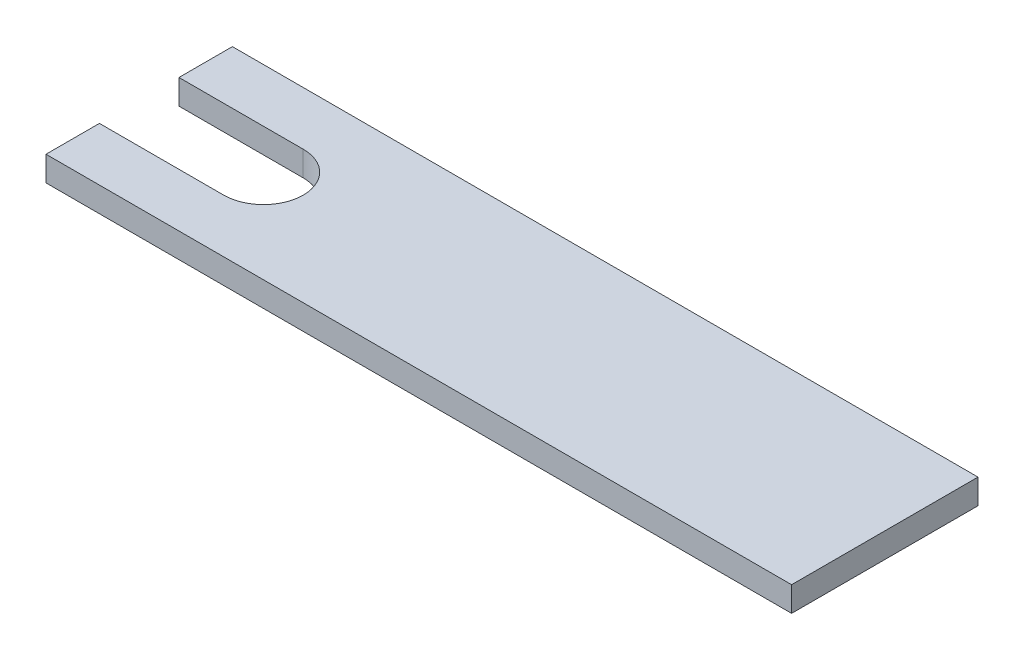
ISO-10303-21;
HEADER;
FILE_DESCRIPTION(('STEP AP214'),'2;1');
FILE_NAME('part.step','',(''),(''),'','','');
FILE_SCHEMA(('AUTOMOTIVE_DESIGN { 1 0 10303 214 1 1 1 1 }'));
ENDSEC;
DATA;
#1=APPLICATION_CONTEXT('core data for automotive mechanical design processes');
#2=APPLICATION_PROTOCOL_DEFINITION('international standard','automotive_design',2000,#1);
#3=PRODUCT_CONTEXT('',#1,'mechanical');
#4=PRODUCT('Part','Part','',(#3));
#5=PRODUCT_RELATED_PRODUCT_CATEGORY('part','',(#4));
#6=PRODUCT_DEFINITION_FORMATION('','',#4);
#7=PRODUCT_DEFINITION_CONTEXT('part definition',#1,'design');
#8=PRODUCT_DEFINITION('design','',#6,#7);
#9=PRODUCT_DEFINITION_SHAPE('','',#8);
#10=(LENGTH_UNIT() NAMED_UNIT(*) SI_UNIT(.MILLI.,.METRE.));
#11=(NAMED_UNIT(*) PLANE_ANGLE_UNIT() SI_UNIT($,.RADIAN.));
#12=(NAMED_UNIT(*) SI_UNIT($,.STERADIAN.) SOLID_ANGLE_UNIT());
#13=UNCERTAINTY_MEASURE_WITH_UNIT(LENGTH_MEASURE(1.E-05),#10,'distance_accuracy_value','');
#14=(GEOMETRIC_REPRESENTATION_CONTEXT(3) GLOBAL_UNCERTAINTY_ASSIGNED_CONTEXT((#13)) GLOBAL_UNIT_ASSIGNED_CONTEXT((#10,
#11,#12)) REPRESENTATION_CONTEXT('',''));
#15=CARTESIAN_POINT('',(0.,0.,0.));
#16=DIRECTION('',(0.,0.,1.));
#17=DIRECTION('',(1.,0.,0.));
#18=AXIS2_PLACEMENT_3D('',#15,#16,#17);
#19=CARTESIAN_POINT('',(5.,1.,0.));
#20=DIRECTION('',(0.,-1.,0.));
#21=DIRECTION('',(0.,0.,-1.));
#22=AXIS2_PLACEMENT_3D('',#19,#20,#21);
#23=CYLINDRICAL_SURFACE('',#22,1.6);
#24=CARTESIAN_POINT('',(5.,0.,0.));
#25=DIRECTION('',(0.,1.,0.));
#26=DIRECTION('',(0.,0.,1.));
#27=AXIS2_PLACEMENT_3D('',#24,#25,#26);
#28=CIRCLE('',#27,1.6);
#29=CARTESIAN_POINT('',(5.,0.,1.6));
#30=VERTEX_POINT('',#29);
#31=CARTESIAN_POINT('',(5.,0.,-1.6));
#32=VERTEX_POINT('',#31);
#33=EDGE_CURVE('E204',#30,#32,#28,.T.);
#34=ORIENTED_EDGE('',*,*,#33,.F.);
#35=DIRECTION('',(0.,-1.,0.));
#36=VECTOR('',#35,1.);
#37=CARTESIAN_POINT('',(5.,1.,1.6));
#38=LINE('',#37,#36);
#39=CARTESIAN_POINT('',(5.,1.,1.6));
#40=VERTEX_POINT('',#39);
#41=EDGE_CURVE('E11',#40,#30,#38,.T.);
#42=ORIENTED_EDGE('',*,*,#41,.F.);
#43=CARTESIAN_POINT('',(5.,1.,0.));
#44=DIRECTION('',(0.,1.,0.));
#45=DIRECTION('',(0.,0.,1.));
#46=AXIS2_PLACEMENT_3D('',#43,#44,#45);
#47=CIRCLE('',#46,1.6);
#48=CARTESIAN_POINT('',(5.,1.,-1.6));
#49=VERTEX_POINT('',#48);
#50=EDGE_CURVE('E167',#40,#49,#47,.T.);
#51=ORIENTED_EDGE('',*,*,#50,.T.);
#52=DIRECTION('',(0.,-1.,0.));
#53=VECTOR('',#52,1.);
#54=CARTESIAN_POINT('',(5.,1.,-1.6));
#55=LINE('',#54,#53);
#56=EDGE_CURVE('E102',#49,#32,#55,.T.);
#57=ORIENTED_EDGE('',*,*,#56,.T.);
#58=EDGE_LOOP('',(#34,#42,#51,#57));
#59=FACE_BOUND('',#58,.T.);
#60=ADVANCED_FACE('F41',(#59),#23,.F.);
#61=CARTESIAN_POINT('',(0.,1.,1.6));
#62=DIRECTION('',(0.,0.,-1.));
#63=DIRECTION('',(-1.,0.,0.));
#64=AXIS2_PLACEMENT_3D('',#61,#62,#63);
#65=PLANE('',#64);
#66=DIRECTION('',(1.,0.,0.));
#67=VECTOR('',#66,1.);
#68=CARTESIAN_POINT('',(0.,0.,1.6));
#69=LINE('',#68,#67);
#70=CARTESIAN_POINT('',(0.,0.,1.6));
#71=VERTEX_POINT('',#70);
#72=EDGE_CURVE('E201',#71,#30,#69,.T.);
#73=ORIENTED_EDGE('',*,*,#72,.F.);
#74=DIRECTION('',(0.,-1.,0.));
#75=VECTOR('',#74,1.);
#76=CARTESIAN_POINT('',(0.,1.,1.6));
#77=LINE('',#76,#75);
#78=CARTESIAN_POINT('',(0.,1.,1.6));
#79=VERTEX_POINT('',#78);
#80=EDGE_CURVE('E50',#79,#71,#77,.T.);
#81=ORIENTED_EDGE('',*,*,#80,.F.);
#82=DIRECTION('',(1.,0.,0.));
#83=VECTOR('',#82,1.);
#84=CARTESIAN_POINT('',(0.,1.,1.6));
#85=LINE('',#84,#83);
#86=EDGE_CURVE('E160',#79,#40,#85,.T.);
#87=ORIENTED_EDGE('',*,*,#86,.T.);
#88=ORIENTED_EDGE('',*,*,#41,.T.);
#89=EDGE_LOOP('',(#73,#81,#87,#88));
#90=FACE_BOUND('',#89,.T.);
#91=ADVANCED_FACE('F202',(#90),#65,.T.);
#92=CARTESIAN_POINT('',(0.,1.,0.));
#93=DIRECTION('',(-1.,0.,0.));
#94=DIRECTION('',(0.,0.,1.));
#95=AXIS2_PLACEMENT_3D('',#92,#93,#94);
#96=PLANE('',#95);
#97=DIRECTION('',(0.,0.,-1.));
#98=VECTOR('',#97,1.);
#99=CARTESIAN_POINT('',(0.,0.,0.));
#100=LINE('',#99,#98);
#101=CARTESIAN_POINT('',(0.,0.,3.75));
#102=VERTEX_POINT('',#101);
#103=EDGE_CURVE('E180',#102,#71,#100,.T.);
#104=ORIENTED_EDGE('',*,*,#103,.F.);
#105=DIRECTION('',(0.,-1.,0.));
#106=VECTOR('',#105,1.);
#107=CARTESIAN_POINT('',(0.,1.,3.75));
#108=LINE('',#107,#106);
#109=CARTESIAN_POINT('',(0.,1.,3.75));
#110=VERTEX_POINT('',#109);
#111=EDGE_CURVE('E192',#110,#102,#108,.T.);
#112=ORIENTED_EDGE('',*,*,#111,.F.);
#113=DIRECTION('',(0.,0.,-1.));
#114=VECTOR('',#113,1.);
#115=CARTESIAN_POINT('',(0.,1.,0.));
#116=LINE('',#115,#114);
#117=EDGE_CURVE('E151',#110,#79,#116,.T.);
#118=ORIENTED_EDGE('',*,*,#117,.T.);
#119=ORIENTED_EDGE('',*,*,#80,.T.);
#120=EDGE_LOOP('',(#104,#112,#118,#119));
#121=FACE_BOUND('',#120,.T.);
#122=ADVANCED_FACE('F197',(#121),#96,.T.);
#123=CARTESIAN_POINT('',(0.,1.,3.75));
#124=DIRECTION('',(0.,0.,1.));
#125=DIRECTION('',(1.,0.,0.));
#126=AXIS2_PLACEMENT_3D('',#123,#124,#125);
#127=PLANE('',#126);
#128=DIRECTION('',(-1.,0.,0.));
#129=VECTOR('',#128,1.);
#130=CARTESIAN_POINT('',(0.,0.,3.75));
#131=LINE('',#130,#129);
#132=CARTESIAN_POINT('',(30.,0.,3.75));
#133=VERTEX_POINT('',#132);
#134=EDGE_CURVE('E209',#133,#102,#131,.T.);
#135=ORIENTED_EDGE('',*,*,#134,.F.);
#136=DIRECTION('',(0.,-1.,0.));
#137=VECTOR('',#136,1.);
#138=CARTESIAN_POINT('',(30.,1.,3.75));
#139=LINE('',#138,#137);
#140=CARTESIAN_POINT('',(30.,1.,3.75));
#141=VERTEX_POINT('',#140);
#142=EDGE_CURVE('E189',#141,#133,#139,.T.);
#143=ORIENTED_EDGE('',*,*,#142,.F.);
#144=DIRECTION('',(-1.,0.,0.));
#145=VECTOR('',#144,1.);
#146=CARTESIAN_POINT('',(0.,1.,3.75));
#147=LINE('',#146,#145);
#148=EDGE_CURVE('E159',#141,#110,#147,.T.);
#149=ORIENTED_EDGE('',*,*,#148,.T.);
#150=ORIENTED_EDGE('',*,*,#111,.T.);
#151=EDGE_LOOP('',(#135,#143,#149,#150));
#152=FACE_BOUND('',#151,.T.);
#153=ADVANCED_FACE('F229',(#152),#127,.T.);
#154=CARTESIAN_POINT('',(30.,1.,0.));
#155=DIRECTION('',(-1.,0.,0.));
#156=DIRECTION('',(0.,0.,1.));
#157=AXIS2_PLACEMENT_3D('',#154,#155,#156);
#158=PLANE('',#157);
#159=DIRECTION('',(0.,0.,-1.));
#160=VECTOR('',#159,1.);
#161=CARTESIAN_POINT('',(30.,0.,0.));
#162=LINE('',#161,#160);
#163=CARTESIAN_POINT('',(30.,0.,-3.75));
#164=VERTEX_POINT('',#163);
#165=EDGE_CURVE('E213',#133,#164,#162,.T.);
#166=ORIENTED_EDGE('',*,*,#165,.T.);
#167=DIRECTION('',(0.,-1.,0.));
#168=VECTOR('',#167,1.);
#169=CARTESIAN_POINT('',(30.,1.,-3.75));
#170=LINE('',#169,#168);
#171=CARTESIAN_POINT('',(30.,1.,-3.75));
#172=VERTEX_POINT('',#171);
#173=EDGE_CURVE('E146',#172,#164,#170,.T.);
#174=ORIENTED_EDGE('',*,*,#173,.F.);
#175=DIRECTION('',(0.,0.,-1.));
#176=VECTOR('',#175,1.);
#177=CARTESIAN_POINT('',(30.,1.,0.));
#178=LINE('',#177,#176);
#179=EDGE_CURVE('E131',#141,#172,#178,.T.);
#180=ORIENTED_EDGE('',*,*,#179,.F.);
#181=ORIENTED_EDGE('',*,*,#142,.T.);
#182=EDGE_LOOP('',(#166,#174,#180,#181));
#183=FACE_BOUND('',#182,.T.);
#184=ADVANCED_FACE('F219',(#183),#158,.F.);
#185=CARTESIAN_POINT('',(0.,1.,-3.75));
#186=DIRECTION('',(0.,0.,1.));
#187=DIRECTION('',(1.,0.,0.));
#188=AXIS2_PLACEMENT_3D('',#185,#186,#187);
#189=PLANE('',#188);
#190=DIRECTION('',(-1.,0.,0.));
#191=VECTOR('',#190,1.);
#192=CARTESIAN_POINT('',(0.,0.,-3.75));
#193=LINE('',#192,#191);
#194=CARTESIAN_POINT('',(0.,0.,-3.75));
#195=VERTEX_POINT('',#194);
#196=EDGE_CURVE('E141',#164,#195,#193,.T.);
#197=ORIENTED_EDGE('',*,*,#196,.T.);
#198=DIRECTION('',(0.,-1.,0.));
#199=VECTOR('',#198,1.);
#200=CARTESIAN_POINT('',(0.,1.,-3.75));
#201=LINE('',#200,#199);
#202=CARTESIAN_POINT('',(0.,1.,-3.75));
#203=VERTEX_POINT('',#202);
#204=EDGE_CURVE('E138',#203,#195,#201,.T.);
#205=ORIENTED_EDGE('',*,*,#204,.F.);
#206=DIRECTION('',(-1.,0.,0.));
#207=VECTOR('',#206,1.);
#208=CARTESIAN_POINT('',(0.,1.,-3.75));
#209=LINE('',#208,#207);
#210=EDGE_CURVE('E124',#172,#203,#209,.T.);
#211=ORIENTED_EDGE('',*,*,#210,.F.);
#212=ORIENTED_EDGE('',*,*,#173,.T.);
#213=EDGE_LOOP('',(#197,#205,#211,#212));
#214=FACE_BOUND('',#213,.T.);
#215=ADVANCED_FACE('F139',(#214),#189,.F.);
#216=CARTESIAN_POINT('',(0.,0.,-1.6));
#217=VERTEX_POINT('',#216);
#218=EDGE_CURVE('E175',#217,#195,#100,.T.);
#219=ORIENTED_EDGE('',*,*,#218,.F.);
#220=DIRECTION('',(0.,-1.,0.));
#221=VECTOR('',#220,1.);
#222=CARTESIAN_POINT('',(0.,1.,-1.6));
#223=LINE('',#222,#221);
#224=CARTESIAN_POINT('',(0.,1.,-1.6));
#225=VERTEX_POINT('',#224);
#226=EDGE_CURVE('E95',#225,#217,#223,.T.);
#227=ORIENTED_EDGE('',*,*,#226,.F.);
#228=EDGE_CURVE('E128',#225,#203,#116,.T.);
#229=ORIENTED_EDGE('',*,*,#228,.T.);
#230=ORIENTED_EDGE('',*,*,#204,.T.);
#231=EDGE_LOOP('',(#219,#227,#229,#230));
#232=FACE_BOUND('',#231,.T.);
#233=ADVANCED_FACE('F148',(#232),#96,.T.);
#234=CARTESIAN_POINT('',(0.,1.,-1.6));
#235=DIRECTION('',(0.,0.,-1.));
#236=DIRECTION('',(-1.,0.,0.));
#237=AXIS2_PLACEMENT_3D('',#234,#235,#236);
#238=PLANE('',#237);
#239=DIRECTION('',(1.,0.,0.));
#240=VECTOR('',#239,1.);
#241=CARTESIAN_POINT('',(0.,0.,-1.6));
#242=LINE('',#241,#240);
#243=EDGE_CURVE('E172',#217,#32,#242,.T.);
#244=ORIENTED_EDGE('',*,*,#243,.T.);
#245=ORIENTED_EDGE('',*,*,#56,.F.);
#246=DIRECTION('',(1.,0.,0.));
#247=VECTOR('',#246,1.);
#248=CARTESIAN_POINT('',(0.,1.,-1.6));
#249=LINE('',#248,#247);
#250=EDGE_CURVE('E61',#225,#49,#249,.T.);
#251=ORIENTED_EDGE('',*,*,#250,.F.);
#252=ORIENTED_EDGE('',*,*,#226,.T.);
#253=EDGE_LOOP('',(#244,#245,#251,#252));
#254=FACE_BOUND('',#253,.T.);
#255=ADVANCED_FACE('F240',(#254),#238,.F.);
#256=CARTESIAN_POINT('',(0.,1.,0.));
#257=DIRECTION('',(0.,1.,0.));
#258=DIRECTION('',(0.,0.,1.));
#259=AXIS2_PLACEMENT_3D('',#256,#257,#258);
#260=PLANE('',#259);
#261=ORIENTED_EDGE('',*,*,#50,.F.);
#262=ORIENTED_EDGE('',*,*,#86,.F.);
#263=ORIENTED_EDGE('',*,*,#117,.F.);
#264=ORIENTED_EDGE('',*,*,#148,.F.);
#265=ORIENTED_EDGE('',*,*,#179,.T.);
#266=ORIENTED_EDGE('',*,*,#210,.T.);
#267=ORIENTED_EDGE('',*,*,#228,.F.);
#268=ORIENTED_EDGE('',*,*,#250,.T.);
#269=EDGE_LOOP('',(#261,#262,#263,#264,#265,#266,#267,#268));
#270=FACE_BOUND('',#269,.T.);
#271=ADVANCED_FACE('F126',(#270),#260,.T.);
#272=CARTESIAN_POINT('',(0.,0.,0.));
#273=DIRECTION('',(0.,1.,0.));
#274=DIRECTION('',(0.,0.,1.));
#275=AXIS2_PLACEMENT_3D('',#272,#273,#274);
#276=PLANE('',#275);
#277=ORIENTED_EDGE('',*,*,#33,.T.);
#278=ORIENTED_EDGE('',*,*,#243,.F.);
#279=ORIENTED_EDGE('',*,*,#218,.T.);
#280=ORIENTED_EDGE('',*,*,#196,.F.);
#281=ORIENTED_EDGE('',*,*,#165,.F.);
#282=ORIENTED_EDGE('',*,*,#134,.T.);
#283=ORIENTED_EDGE('',*,*,#103,.T.);
#284=ORIENTED_EDGE('',*,*,#72,.T.);
#285=EDGE_LOOP('',(#277,#278,#279,#280,#281,#282,#283,#284));
#286=FACE_BOUND('',#285,.T.);
#287=ADVANCED_FACE('F206',(#286),#276,.F.);
#288=CLOSED_SHELL('',(#60,#91,#122,#153,#184,#215,#233,#255,#271,#287));
#289=MANIFOLD_SOLID_BREP('B2',#288);
#290=ADVANCED_BREP_SHAPE_REPRESENTATION('',(#18,#289),#14);
#291=SHAPE_DEFINITION_REPRESENTATION(#9,#290);
ENDSEC;
END-ISO-10303-21;
